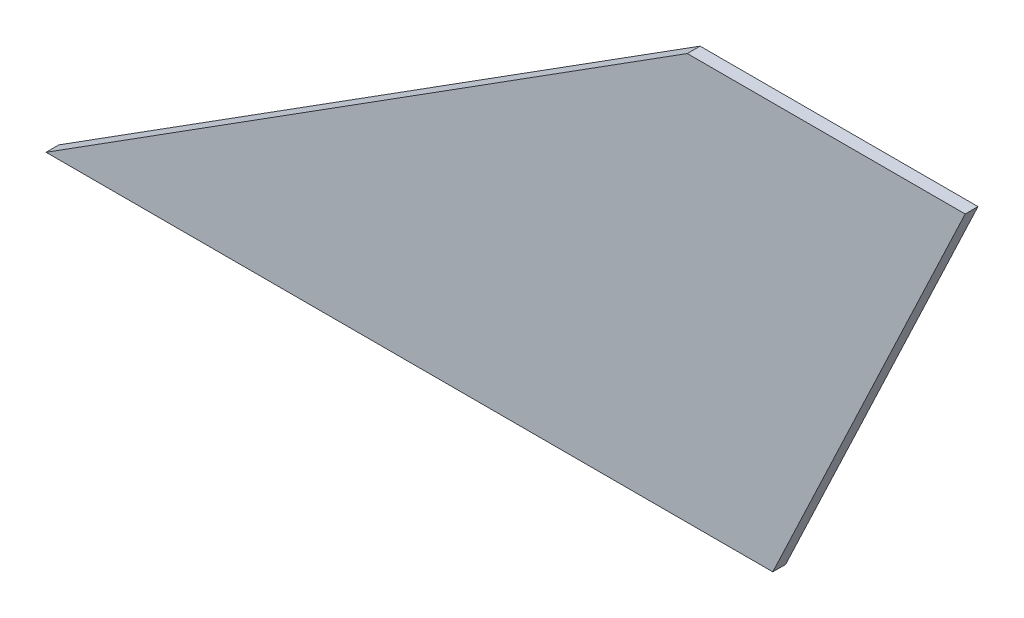
ISO-10303-21;
HEADER;
FILE_DESCRIPTION(('STEP AP214'),'2;1');
FILE_NAME('part.step','',(''),(''),'','','');
FILE_SCHEMA(('AUTOMOTIVE_DESIGN { 1 0 10303 214 1 1 1 1 }'));
ENDSEC;
DATA;
#1=APPLICATION_CONTEXT('core data for automotive mechanical design processes');
#2=APPLICATION_PROTOCOL_DEFINITION('international standard','automotive_design',2000,#1);
#3=PRODUCT_CONTEXT('',#1,'mechanical');
#4=PRODUCT('Part','Part','',(#3));
#5=PRODUCT_RELATED_PRODUCT_CATEGORY('part','',(#4));
#6=PRODUCT_DEFINITION_FORMATION('','',#4);
#7=PRODUCT_DEFINITION_CONTEXT('part definition',#1,'design');
#8=PRODUCT_DEFINITION('design','',#6,#7);
#9=PRODUCT_DEFINITION_SHAPE('','',#8);
#10=(LENGTH_UNIT() NAMED_UNIT(*) SI_UNIT(.MILLI.,.METRE.));
#11=(NAMED_UNIT(*) PLANE_ANGLE_UNIT() SI_UNIT($,.RADIAN.));
#12=(NAMED_UNIT(*) SI_UNIT($,.STERADIAN.) SOLID_ANGLE_UNIT());
#13=UNCERTAINTY_MEASURE_WITH_UNIT(LENGTH_MEASURE(1.E-05),#10,'distance_accuracy_value','');
#14=(GEOMETRIC_REPRESENTATION_CONTEXT(3) GLOBAL_UNCERTAINTY_ASSIGNED_CONTEXT((#13)) GLOBAL_UNIT_ASSIGNED_CONTEXT((#10,
#11,#12)) REPRESENTATION_CONTEXT('',''));
#15=CARTESIAN_POINT('',(0.,0.,0.));
#16=DIRECTION('',(0.,0.,1.));
#17=DIRECTION('',(1.,0.,0.));
#18=AXIS2_PLACEMENT_3D('',#15,#16,#17);
#19=CARTESIAN_POINT('',(150.,95.,3.));
#20=DIRECTION('',(0.535052081184345,-0.844819075554228,0.));
#21=DIRECTION('',(0.844819075554228,0.535052081184345,0.));
#22=AXIS2_PLACEMENT_3D('',#19,#20,#21);
#23=PLANE('',#22);
#24=DIRECTION('',(-0.844819075554229,-0.535052081184345,0.));
#25=VECTOR('',#24,1.);
#26=CARTESIAN_POINT('',(150.,95.,0.));
#27=LINE('',#26,#25);
#28=CARTESIAN_POINT('',(150.,95.,0.));
#29=VERTEX_POINT('',#28);
#30=CARTESIAN_POINT('',(0.,0.,0.));
#31=VERTEX_POINT('',#30);
#32=EDGE_CURVE('E113',#29,#31,#27,.T.);
#33=ORIENTED_EDGE('',*,*,#32,.T.);
#34=DIRECTION('',(0.,0.,-1.));
#35=VECTOR('',#34,1.);
#36=CARTESIAN_POINT('',(0.,0.,3.));
#37=LINE('',#36,#35);
#38=CARTESIAN_POINT('',(0.,0.,3.));
#39=VERTEX_POINT('',#38);
#40=EDGE_CURVE('E12',#39,#31,#37,.T.);
#41=ORIENTED_EDGE('',*,*,#40,.F.);
#42=DIRECTION('',(-0.844819075554229,-0.535052081184345,0.));
#43=VECTOR('',#42,1.);
#44=CARTESIAN_POINT('',(150.,95.,3.));
#45=LINE('',#44,#43);
#46=CARTESIAN_POINT('',(150.,95.,3.));
#47=VERTEX_POINT('',#46);
#48=EDGE_CURVE('E96',#47,#39,#45,.T.);
#49=ORIENTED_EDGE('',*,*,#48,.F.);
#50=DIRECTION('',(0.,0.,-1.));
#51=VECTOR('',#50,1.);
#52=CARTESIAN_POINT('',(150.,95.,3.));
#53=LINE('',#52,#51);
#54=EDGE_CURVE('E108',#47,#29,#53,.T.);
#55=ORIENTED_EDGE('',*,*,#54,.T.);
#56=EDGE_LOOP('',(#33,#41,#49,#55));
#57=FACE_BOUND('',#56,.T.);
#58=ADVANCED_FACE('F43',(#57),#23,.F.);
#59=CARTESIAN_POINT('',(0.,0.,3.));
#60=DIRECTION('',(0.,1.,0.));
#61=DIRECTION('',(0.,0.,1.));
#62=AXIS2_PLACEMENT_3D('',#59,#60,#61);
#63=PLANE('',#62);
#64=DIRECTION('',(1.,0.,0.));
#65=VECTOR('',#64,1.);
#66=CARTESIAN_POINT('',(0.,0.,0.));
#67=LINE('',#66,#65);
#68=CARTESIAN_POINT('',(170.,0.,0.));
#69=VERTEX_POINT('',#68);
#70=EDGE_CURVE('E101',#31,#69,#67,.T.);
#71=ORIENTED_EDGE('',*,*,#70,.T.);
#72=DIRECTION('',(0.,0.,-1.));
#73=VECTOR('',#72,1.);
#74=CARTESIAN_POINT('',(170.,0.,3.));
#75=LINE('',#74,#73);
#76=CARTESIAN_POINT('',(170.,0.,3.));
#77=VERTEX_POINT('',#76);
#78=EDGE_CURVE('E53',#77,#69,#75,.T.);
#79=ORIENTED_EDGE('',*,*,#78,.F.);
#80=DIRECTION('',(1.,0.,0.));
#81=VECTOR('',#80,1.);
#82=CARTESIAN_POINT('',(0.,0.,3.));
#83=LINE('',#82,#81);
#84=EDGE_CURVE('E91',#39,#77,#83,.T.);
#85=ORIENTED_EDGE('',*,*,#84,.F.);
#86=ORIENTED_EDGE('',*,*,#40,.T.);
#87=EDGE_LOOP('',(#71,#79,#85,#86));
#88=FACE_BOUND('',#87,.T.);
#89=ADVANCED_FACE('F100',(#88),#63,.F.);
#90=CARTESIAN_POINT('',(170.,0.,3.));
#91=DIRECTION('',(-0.903737838893539,0.428086344739044,0.));
#92=DIRECTION('',(-0.428086344739044,-0.903737838893539,0.));
#93=AXIS2_PLACEMENT_3D('',#90,#91,#92);
#94=PLANE('',#93);
#95=DIRECTION('',(0.428086344739044,0.903737838893539,0.));
#96=VECTOR('',#95,1.);
#97=CARTESIAN_POINT('',(170.,0.,0.));
#98=LINE('',#97,#96);
#99=CARTESIAN_POINT('',(215.,95.,0.));
#100=VERTEX_POINT('',#99);
#101=EDGE_CURVE('E78',#69,#100,#98,.T.);
#102=ORIENTED_EDGE('',*,*,#101,.T.);
#103=DIRECTION('',(0.,0.,-1.));
#104=VECTOR('',#103,1.);
#105=CARTESIAN_POINT('',(215.,95.,3.));
#106=LINE('',#105,#104);
#107=CARTESIAN_POINT('',(215.,95.,3.));
#108=VERTEX_POINT('',#107);
#109=EDGE_CURVE('E103',#108,#100,#106,.T.);
#110=ORIENTED_EDGE('',*,*,#109,.F.);
#111=DIRECTION('',(0.428086344739044,0.903737838893539,0.));
#112=VECTOR('',#111,1.);
#113=CARTESIAN_POINT('',(170.,0.,3.));
#114=LINE('',#113,#112);
#115=EDGE_CURVE('E94',#77,#108,#114,.T.);
#116=ORIENTED_EDGE('',*,*,#115,.F.);
#117=ORIENTED_EDGE('',*,*,#78,.T.);
#118=EDGE_LOOP('',(#102,#110,#116,#117));
#119=FACE_BOUND('',#118,.T.);
#120=ADVANCED_FACE('F104',(#119),#94,.F.);
#121=CARTESIAN_POINT('',(215.,95.,3.));
#122=DIRECTION('',(0.,-1.,0.));
#123=DIRECTION('',(1.,0.,0.));
#124=AXIS2_PLACEMENT_3D('',#121,#122,#123);
#125=PLANE('',#124);
#126=DIRECTION('',(-1.,0.,0.));
#127=VECTOR('',#126,1.);
#128=CARTESIAN_POINT('',(215.,95.,0.));
#129=LINE('',#128,#127);
#130=EDGE_CURVE('E84',#100,#29,#129,.T.);
#131=ORIENTED_EDGE('',*,*,#130,.T.);
#132=ORIENTED_EDGE('',*,*,#54,.F.);
#133=DIRECTION('',(-1.,0.,0.));
#134=VECTOR('',#133,1.);
#135=CARTESIAN_POINT('',(215.,95.,3.));
#136=LINE('',#135,#134);
#137=EDGE_CURVE('E61',#108,#47,#136,.T.);
#138=ORIENTED_EDGE('',*,*,#137,.F.);
#139=ORIENTED_EDGE('',*,*,#109,.T.);
#140=EDGE_LOOP('',(#131,#132,#138,#139));
#141=FACE_BOUND('',#140,.T.);
#142=ADVANCED_FACE('F147',(#141),#125,.F.);
#143=CARTESIAN_POINT('',(0.,0.,3.));
#144=DIRECTION('',(0.,0.,1.));
#145=DIRECTION('',(1.,0.,0.));
#146=AXIS2_PLACEMENT_3D('',#143,#144,#145);
#147=PLANE('',#146);
#148=ORIENTED_EDGE('',*,*,#48,.T.);
#149=ORIENTED_EDGE('',*,*,#84,.T.);
#150=ORIENTED_EDGE('',*,*,#115,.T.);
#151=ORIENTED_EDGE('',*,*,#137,.T.);
#152=EDGE_LOOP('',(#148,#149,#150,#151));
#153=FACE_BOUND('',#152,.T.);
#154=ADVANCED_FACE('F92',(#153),#147,.T.);
#155=CARTESIAN_POINT('',(0.,0.,0.));
#156=DIRECTION('',(0.,0.,1.));
#157=DIRECTION('',(1.,0.,0.));
#158=AXIS2_PLACEMENT_3D('',#155,#156,#157);
#159=PLANE('',#158);
#160=ORIENTED_EDGE('',*,*,#32,.F.);
#161=ORIENTED_EDGE('',*,*,#130,.F.);
#162=ORIENTED_EDGE('',*,*,#101,.F.);
#163=ORIENTED_EDGE('',*,*,#70,.F.);
#164=EDGE_LOOP('',(#160,#161,#162,#163));
#165=FACE_BOUND('',#164,.T.);
#166=ADVANCED_FACE('F141',(#165),#159,.F.);
#167=CLOSED_SHELL('',(#58,#89,#120,#142,#154,#166));
#168=MANIFOLD_SOLID_BREP('B2',#167);
#169=ADVANCED_BREP_SHAPE_REPRESENTATION('',(#18,#168),#14);
#170=SHAPE_DEFINITION_REPRESENTATION(#9,#169);
ENDSEC;
END-ISO-10303-21;
